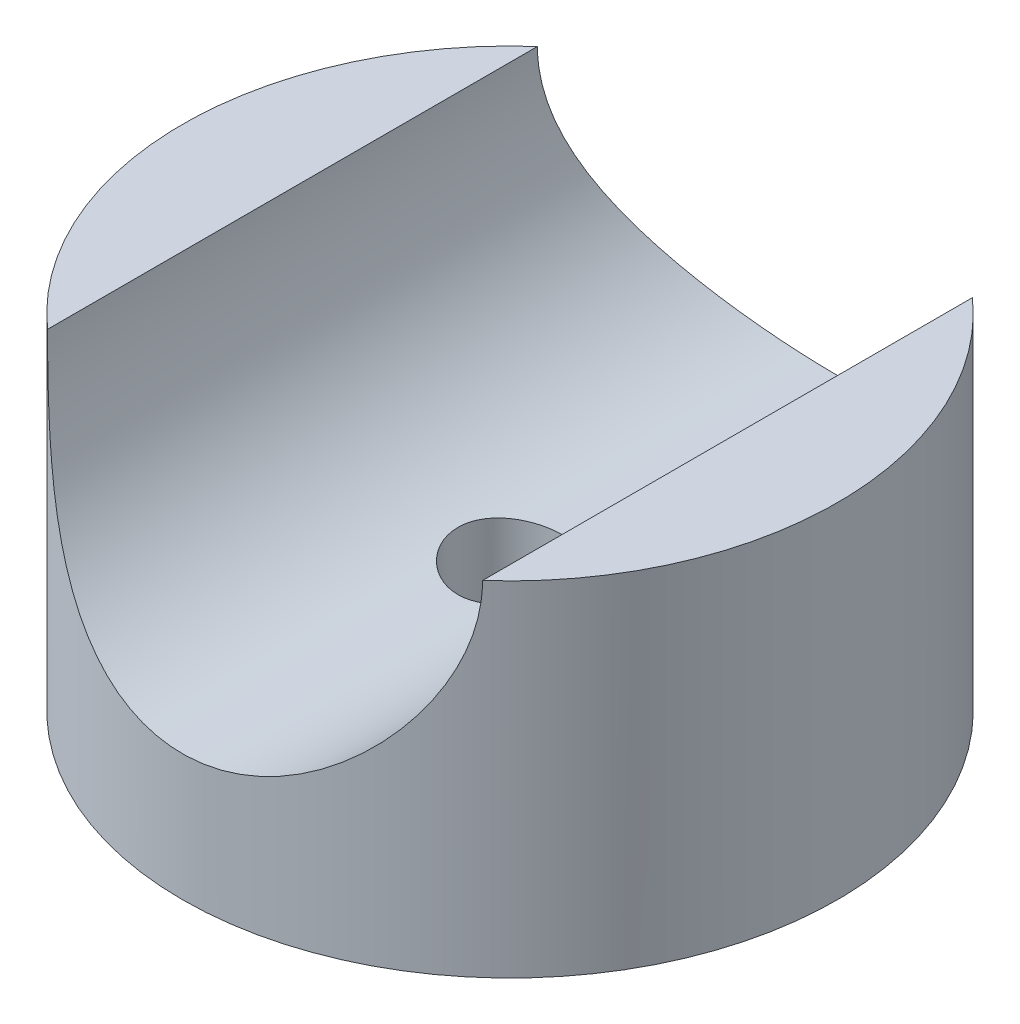
ISO-10303-21;
HEADER;
FILE_DESCRIPTION(('STEP AP214'),'2;1');
FILE_NAME('part.step','',(''),(''),'','','');
FILE_SCHEMA(('AUTOMOTIVE_DESIGN { 1 0 10303 214 1 1 1 1 }'));
ENDSEC;
DATA;
#1=APPLICATION_CONTEXT('core data for automotive mechanical design processes');
#2=APPLICATION_PROTOCOL_DEFINITION('international standard','automotive_design',2000,#1);
#3=PRODUCT_CONTEXT('',#1,'mechanical');
#4=PRODUCT('Part','Part','',(#3));
#5=PRODUCT_RELATED_PRODUCT_CATEGORY('part','',(#4));
#6=PRODUCT_DEFINITION_FORMATION('','',#4);
#7=PRODUCT_DEFINITION_CONTEXT('part definition',#1,'design');
#8=PRODUCT_DEFINITION('design','',#6,#7);
#9=PRODUCT_DEFINITION_SHAPE('','',#8);
#10=(LENGTH_UNIT() NAMED_UNIT(*) SI_UNIT(.MILLI.,.METRE.));
#11=(NAMED_UNIT(*) PLANE_ANGLE_UNIT() SI_UNIT($,.RADIAN.));
#12=(NAMED_UNIT(*) SI_UNIT($,.STERADIAN.) SOLID_ANGLE_UNIT());
#13=UNCERTAINTY_MEASURE_WITH_UNIT(LENGTH_MEASURE(1.E-05),#10,'distance_accuracy_value','');
#14=(GEOMETRIC_REPRESENTATION_CONTEXT(3) GLOBAL_UNCERTAINTY_ASSIGNED_CONTEXT((#13)) GLOBAL_UNIT_ASSIGNED_CONTEXT((#10,
#11,#12)) REPRESENTATION_CONTEXT('',''));
#15=CARTESIAN_POINT('',(0.,0.,0.));
#16=DIRECTION('',(0.,0.,1.));
#17=DIRECTION('',(1.,0.,0.));
#18=AXIS2_PLACEMENT_3D('',#15,#16,#17);
#19=CARTESIAN_POINT('',(0.,33.3375,0.));
#20=DIRECTION('',(0.,-1.,0.));
#21=DIRECTION('',(0.,0.,-1.));
#22=AXIS2_PLACEMENT_3D('',#19,#20,#21);
#23=CYLINDRICAL_SURFACE('',#22,31.75);
#24=CARTESIAN_POINT('',(0.,0.,0.));
#25=DIRECTION('',(0.,1.,0.));
#26=DIRECTION('',(0.,0.,1.));
#27=AXIS2_PLACEMENT_3D('',#24,#25,#26);
#28=CIRCLE('',#27,31.75);
#29=CARTESIAN_POINT('',(0.,0.,31.75));
#30=VERTEX_POINT('',#29);
#31=EDGE_CURVE('E154',#30,#30,#28,.T.);
#32=ORIENTED_EDGE('',*,*,#31,.T.);
#33=EDGE_LOOP('',(#32));
#34=FACE_BOUND('',#33,.T.);
#35=CARTESIAN_POINT('',(-21.082,33.3375,23.7405091773534));
#36=CARTESIAN_POINT('',(-21.0820090227909,33.0780918503218,23.740490377066));
#37=CARTESIAN_POINT('',(-21.0772123046933,32.8186913512447,23.7447604710367));
#38=CARTESIAN_POINT('',(-21.0580756657229,32.3005439909637,23.7617391651915));
#39=CARTESIAN_POINT('',(-21.0437366847969,32.0417970679,23.7744469342345));
#40=CARTESIAN_POINT('',(-21.0056085016833,31.5258784470475,23.808139896179));
#41=CARTESIAN_POINT('',(-20.9818315731884,31.26870514216,23.8291143383363));
#42=CARTESIAN_POINT('',(-20.9249629270465,30.7561904809237,23.8790670850276));
#43=CARTESIAN_POINT('',(-20.8918710546845,30.5008491550752,23.9080455225025));
#44=CARTESIAN_POINT('',(-20.7795966037933,29.7433749630778,24.0058495110462));
#45=CARTESIAN_POINT('',(-20.6870236176231,29.2445763238106,24.0858970060874));
#46=CARTESIAN_POINT('',(-20.4675719968932,28.2597009156855,24.2726519768399));
#47=CARTESIAN_POINT('',(-20.3406835334379,27.7736278355959,24.3793670902234));
#48=CARTESIAN_POINT('',(-20.0551860927163,26.8192937073484,24.6147521332039));
#49=CARTESIAN_POINT('',(-19.8967444776864,26.3509535726325,24.743305721062));
#50=CARTESIAN_POINT('',(-19.549522109133,25.4312646737433,25.0185476651443));
#51=CARTESIAN_POINT('',(-19.3607428674325,24.9799150642593,25.1652351176146));
#52=CARTESIAN_POINT('',(-18.9538945964859,24.0941913861639,25.4730760345858));
#53=CARTESIAN_POINT('',(-18.7357492930521,23.659865459983,25.6342667951731));
#54=CARTESIAN_POINT('',(-18.2719011172895,22.8102661386419,25.9669329109378));
#55=CARTESIAN_POINT('',(-18.0261946244101,22.3949952567499,26.1384096159392));
#56=CARTESIAN_POINT('',(-17.4687307709766,21.5221800188763,26.5148195640387));
#57=CARTESIAN_POINT('',(-17.1526193259433,21.0678884795173,26.7208576529895));
#58=CARTESIAN_POINT('',(-16.4866674024411,20.1866220599799,27.1368102172478));
#59=CARTESIAN_POINT('',(-16.1368246959048,19.7596489873847,27.3467249478797));
#60=CARTESIAN_POINT('',(-15.404427421705,18.9340660016095,27.7658817303125));
#61=CARTESIAN_POINT('',(-15.0218614705024,18.5354660477504,27.9751235215356));
#62=CARTESIAN_POINT('',(-14.225160066434,17.7682543081384,28.388532598589));
#63=CARTESIAN_POINT('',(-13.8110224764394,17.3996445559623,28.5926995396528));
#64=CARTESIAN_POINT('',(-12.8906541227297,16.6436270982305,29.0204504214031));
#65=CARTESIAN_POINT('',(-12.3797325472633,16.261101108049,29.2426215254748));
#66=CARTESIAN_POINT('',(-11.319978852129,15.5408924890259,29.6689535645463));
#67=CARTESIAN_POINT('',(-10.7711422019048,15.2032152333974,29.8731123405529));
#68=CARTESIAN_POINT('',(-9.63873569530124,14.5768016300742,30.257469600976));
#69=CARTESIAN_POINT('',(-9.05519189398004,14.2880291802348,30.4376857387814));
#70=CARTESIAN_POINT('',(-7.85685191226056,13.7633294792586,30.768790833652));
#71=CARTESIAN_POINT('',(-7.24206239511081,13.5273910186412,30.9196860106749));
#72=CARTESIAN_POINT('',(-6.05636061106152,13.1356075296996,31.1722380927949));
#73=CARTESIAN_POINT('',(-5.48819774471957,12.973765772761,31.277508847243));
#74=CARTESIAN_POINT('',(-4.33571488794643,12.6976534494025,31.4579734622825));
#75=CARTESIAN_POINT('',(-3.75139598456257,12.5833796906703,31.5331693412006));
#76=CARTESIAN_POINT('',(-2.57257500031857,12.4045685144908,31.6511435168479));
#77=CARTESIAN_POINT('',(-1.9780841881199,12.3399792944497,31.6939555771413));
#78=CARTESIAN_POINT('',(-0.784327112476878,12.2616089132215,31.7459300143005));
#79=CARTESIAN_POINT('',(-0.185061525793987,12.2478206756706,31.7550970777726));
#80=CARTESIAN_POINT('',(0.921465757098503,12.2695143025169,31.7406964630611));
#81=CARTESIAN_POINT('',(1.4289486061586,12.2978669267167,31.7218652640349));
#82=CARTESIAN_POINT('',(2.43904647821122,12.3909268854618,31.6602190662402));
#83=CARTESIAN_POINT('',(2.94166211574552,12.4556295678692,31.6174071365656));
#84=CARTESIAN_POINT('',(3.93850832964898,12.6204984441264,31.5087621967979));
#85=CARTESIAN_POINT('',(4.4327385470839,12.720666152048,31.4429282038491));
#86=CARTESIAN_POINT('',(5.40959899669538,12.9551718116787,31.2896661285821));
#87=CARTESIAN_POINT('',(5.89222872724975,13.0895112381246,31.2022371143001));
#88=CARTESIAN_POINT('',(6.84135365573494,13.3902305997755,31.0079379577901));
#89=CARTESIAN_POINT('',(7.30790083008422,13.5564930646908,30.9011391698445));
#90=CARTESIAN_POINT('',(8.22437204517871,13.9196371132374,30.6699457591024));
#91=CARTESIAN_POINT('',(8.67429637318827,14.1165181674333,30.5455514405589));
#92=CARTESIAN_POINT('',(9.55568305625259,14.5391348358899,30.2813985902901));
#93=CARTESIAN_POINT('',(9.9871448659889,14.7648713016549,30.1416396051806));
#94=CARTESIAN_POINT('',(10.8301608538517,15.2434861116723,29.8491078695759));
#95=CARTESIAN_POINT('',(11.2417126947778,15.4963676312792,29.6963335970201));
#96=CARTESIAN_POINT('',(12.0962774333143,16.0624668141657,29.3594992728853));
#97=CARTESIAN_POINT('',(12.5363493045039,16.379248829271,29.1739625187886));
#98=CARTESIAN_POINT('',(13.388213786791,17.043383968745,28.7929852060464));
#99=CARTESIAN_POINT('',(13.8000042832326,17.3907393747274,28.5975439087129));
#100=CARTESIAN_POINT('',(14.5948008820338,18.1147573215485,28.2002116804099));
#101=CARTESIAN_POINT('',(14.9777658331089,18.4914602551169,27.998312093945));
#102=CARTESIAN_POINT('',(15.7133168749952,19.2722904082029,27.5922216524479));
#103=CARTESIAN_POINT('',(16.0659015094297,19.6764189407951,27.388030688101));
#104=CARTESIAN_POINT('',(16.7914992711841,20.5750894349319,26.9502140910112));
#105=CARTESIAN_POINT('',(17.1593253411772,21.0739818686823,26.7168871716133));
#106=CARTESIAN_POINT('',(17.8514579065122,22.1053174095701,26.2594760149134));
#107=CARTESIAN_POINT('',(18.1757543142695,22.6377682516823,26.0353939283179));
#108=CARTESIAN_POINT('',(18.7780807962199,23.7341047226495,25.604358886339));
#109=CARTESIAN_POINT('',(19.0561582069833,24.2979573900388,25.3973885160685));
#110=CARTESIAN_POINT('',(19.5633369760471,25.4555329793231,25.0088074497082));
#111=CARTESIAN_POINT('',(19.7924629675903,26.049240690913,24.8271840146132));
#112=CARTESIAN_POINT('',(20.1416304325732,27.094209365323,24.5440977121144));
#113=CARTESIAN_POINT('',(20.2742771841316,27.5390596677897,24.4344009091089));
#114=CARTESIAN_POINT('',(20.5108009968017,28.4410680200279,24.2362000505806));
#115=CARTESIAN_POINT('',(20.6146778934379,28.8982261401461,24.1476961162167));
#116=CARTESIAN_POINT('',(20.7919601250261,29.8210698895039,23.9952195403173));
#117=CARTESIAN_POINT('',(20.8654517849675,30.286727381002,23.9311774423084));
#118=CARTESIAN_POINT('',(20.9811673796726,31.2246149234572,23.8297947487042));
#119=CARTESIAN_POINT('',(21.0234110207118,31.6968406404358,23.7924373251757));
#120=CARTESIAN_POINT('',(21.0604436352067,32.3646971110342,23.7596371548319));
#121=CARTESIAN_POINT('',(21.0685258482691,32.5591367900185,23.7524688704416));
#122=CARTESIAN_POINT('',(21.0793030406792,32.9482091654661,23.7429047985081));
#123=CARTESIAN_POINT('',(21.0820000478028,33.1428417616566,23.7405072145794));
#124=CARTESIAN_POINT('',(21.082,33.3375,23.7405091773534));
#125=B_SPLINE_CURVE_WITH_KNOTS('',3,(#35,#36,#37,#38,#39,#40,#41,#42,#43,#44,#45,#46,#47,#48,
#49,#50,#51,#52,#53,#54,#55,#56,#57,#58,#59,#60,#61,#62,#63,#64,#65,#66,#67,#68,#69,#70,#71,#72,
#73,#74,#75,#76,#77,#78,#79,#80,#81,#82,#83,#84,#85,#86,#87,#88,#89,#90,#91,#92,#93,#94,#95,#96,
#97,#98,#99,#100,#101,#102,#103,#104,#105,#106,#107,#108,#109,#110,#111,#112,#113,#114,#115,
#116,#117,#118,#119,#120,#121,#122,#123,#124),.UNSPECIFIED.,.F.,.F.,(4,2,2,2,2,2,2,2,2,2,2,2,2,
2,2,2,2,2,2,2,2,2,2,2,2,2,2,2,2,2,2,2,2,2,2,2,2,2,2,2,2,2,2,2,4),(0.,0.778131872105693,
1.5561871068051,2.33323380790057,3.11029341598251,4.64874928259056,6.18764627279088,
7.71858830269956,9.24945406440585,10.7843756437644,12.3194990933463,14.0894888650037,
15.8595956308583,17.6303206934076,19.4011657254476,21.4258972250682,23.4508710842315,
25.4743435037056,27.4973862071826,29.2948922705328,31.0922776828933,32.8877865375651,
34.6830452759207,36.2070670893669,37.7308939005136,39.2547857746734,40.7787434260512,
42.2971971283681,43.8156245775495,45.3340968448728,46.8527469329181,48.5703358810481,
50.2880531172799,52.0081777982636,53.7283848930412,55.7129402212083,57.6979546600837,
59.680923389499,61.6628918903462,63.0925372935345,64.5221908697572,65.9477543929,
67.3724181292655,67.9565285811316,68.5404190472373),.UNSPECIFIED.);
#126=CARTESIAN_POINT('',(-21.082,33.3375,23.7405091773534));
#127=VERTEX_POINT('',#126);
#128=CARTESIAN_POINT('',(21.082,33.3375,23.7405091773534));
#129=VERTEX_POINT('',#128);
#130=EDGE_CURVE('E60',#127,#129,#125,.T.);
#131=ORIENTED_EDGE('',*,*,#130,.F.);
#132=CARTESIAN_POINT('',(0.,33.3375,0.));
#133=DIRECTION('',(0.,1.,0.));
#134=DIRECTION('',(0.,0.,1.));
#135=AXIS2_PLACEMENT_3D('',#132,#133,#134);
#136=CIRCLE('',#135,31.75);
#137=CARTESIAN_POINT('',(-21.082,33.3375,-23.7405091773534));
#138=VERTEX_POINT('',#137);
#139=EDGE_CURVE('E47',#138,#127,#136,.T.);
#140=ORIENTED_EDGE('',*,*,#139,.F.);
#141=CARTESIAN_POINT('',(21.082,33.3375,-23.7405091773534));
#142=CARTESIAN_POINT('',(21.0820090227909,33.0780918503218,-23.740490377066));
#143=CARTESIAN_POINT('',(21.0772123046933,32.8186913512447,-23.7447604710367));
#144=CARTESIAN_POINT('',(21.0580756657229,32.3005439909637,-23.7617391651915));
#145=CARTESIAN_POINT('',(21.0437366847969,32.0417970679,-23.7744469342345));
#146=CARTESIAN_POINT('',(21.0056085016833,31.5258784470475,-23.808139896179));
#147=CARTESIAN_POINT('',(20.9818315731884,31.26870514216,-23.8291143383363));
#148=CARTESIAN_POINT('',(20.9249629270465,30.7561904809237,-23.8790670850276));
#149=CARTESIAN_POINT('',(20.8918710546845,30.5008491550752,-23.9080455225025));
#150=CARTESIAN_POINT('',(20.7795966037933,29.7433749630778,-24.0058495110462));
#151=CARTESIAN_POINT('',(20.6870236176231,29.2445763238106,-24.0858970060874));
#152=CARTESIAN_POINT('',(20.4675719968932,28.2597009156855,-24.2726519768399));
#153=CARTESIAN_POINT('',(20.3406835334379,27.7736278355959,-24.3793670902234));
#154=CARTESIAN_POINT('',(20.0551860927163,26.8192937073484,-24.6147521332039));
#155=CARTESIAN_POINT('',(19.8967444776864,26.3509535726325,-24.743305721062));
#156=CARTESIAN_POINT('',(19.549522109133,25.4312646737433,-25.0185476651443));
#157=CARTESIAN_POINT('',(19.3607428674325,24.9799150642593,-25.1652351176146));
#158=CARTESIAN_POINT('',(18.9538945964859,24.0941913861639,-25.4730760345858));
#159=CARTESIAN_POINT('',(18.7357492930521,23.659865459983,-25.6342667951731));
#160=CARTESIAN_POINT('',(18.2719011172895,22.8102661386419,-25.9669329109378));
#161=CARTESIAN_POINT('',(18.0261946244101,22.3949952567499,-26.1384096159392));
#162=CARTESIAN_POINT('',(17.4687307709766,21.5221800188763,-26.5148195640387));
#163=CARTESIAN_POINT('',(17.1526193259433,21.0678884795173,-26.7208576529895));
#164=CARTESIAN_POINT('',(16.4866674024411,20.1866220599799,-27.1368102172478));
#165=CARTESIAN_POINT('',(16.1368246959048,19.7596489873847,-27.3467249478797));
#166=CARTESIAN_POINT('',(15.404427421705,18.9340660016095,-27.7658817303125));
#167=CARTESIAN_POINT('',(15.0218614705024,18.5354660477504,-27.9751235215356));
#168=CARTESIAN_POINT('',(14.225160066434,17.7682543081384,-28.388532598589));
#169=CARTESIAN_POINT('',(13.8110224764394,17.3996445559623,-28.5926995396528));
#170=CARTESIAN_POINT('',(12.8906541227297,16.6436270982305,-29.0204504214031));
#171=CARTESIAN_POINT('',(12.3797325472633,16.261101108049,-29.2426215254748));
#172=CARTESIAN_POINT('',(11.319978852129,15.5408924890259,-29.6689535645463));
#173=CARTESIAN_POINT('',(10.7711422019048,15.2032152333974,-29.8731123405529));
#174=CARTESIAN_POINT('',(9.63873569530124,14.5768016300742,-30.257469600976));
#175=CARTESIAN_POINT('',(9.05519189398004,14.2880291802348,-30.4376857387814));
#176=CARTESIAN_POINT('',(7.85685191226056,13.7633294792586,-30.768790833652));
#177=CARTESIAN_POINT('',(7.24206239511081,13.5273910186412,-30.9196860106749));
#178=CARTESIAN_POINT('',(6.05636061106152,13.1356075296996,-31.1722380927949));
#179=CARTESIAN_POINT('',(5.48819774471957,12.973765772761,-31.277508847243));
#180=CARTESIAN_POINT('',(4.33571488794643,12.6976534494025,-31.4579734622825));
#181=CARTESIAN_POINT('',(3.75139598456257,12.5833796906703,-31.5331693412006));
#182=CARTESIAN_POINT('',(2.57257500031857,12.4045685144908,-31.6511435168479));
#183=CARTESIAN_POINT('',(1.9780841881199,12.3399792944497,-31.6939555771413));
#184=CARTESIAN_POINT('',(0.784327112476878,12.2616089132215,-31.7459300143005));
#185=CARTESIAN_POINT('',(0.185061525793987,12.2478206756706,-31.7550970777726));
#186=CARTESIAN_POINT('',(-0.921465757098503,12.2695143025169,-31.7406964630611));
#187=CARTESIAN_POINT('',(-1.4289486061586,12.2978669267167,-31.7218652640349));
#188=CARTESIAN_POINT('',(-2.43904647821122,12.3909268854618,-31.6602190662402));
#189=CARTESIAN_POINT('',(-2.94166211574552,12.4556295678692,-31.6174071365656));
#190=CARTESIAN_POINT('',(-3.93850832964898,12.6204984441264,-31.5087621967979));
#191=CARTESIAN_POINT('',(-4.4327385470839,12.720666152048,-31.4429282038491));
#192=CARTESIAN_POINT('',(-5.40959899669538,12.9551718116787,-31.2896661285821));
#193=CARTESIAN_POINT('',(-5.89222872724975,13.0895112381246,-31.2022371143001));
#194=CARTESIAN_POINT('',(-6.84135365573494,13.3902305997755,-31.0079379577901));
#195=CARTESIAN_POINT('',(-7.30790083008422,13.5564930646908,-30.9011391698445));
#196=CARTESIAN_POINT('',(-8.22437204517871,13.9196371132374,-30.6699457591024));
#197=CARTESIAN_POINT('',(-8.67429637318827,14.1165181674333,-30.5455514405589));
#198=CARTESIAN_POINT('',(-9.55568305625259,14.5391348358899,-30.2813985902901));
#199=CARTESIAN_POINT('',(-9.9871448659889,14.7648713016549,-30.1416396051806));
#200=CARTESIAN_POINT('',(-10.8301608538517,15.2434861116723,-29.8491078695759));
#201=CARTESIAN_POINT('',(-11.2417126947778,15.4963676312792,-29.6963335970201));
#202=CARTESIAN_POINT('',(-12.0962774333143,16.0624668141657,-29.3594992728853));
#203=CARTESIAN_POINT('',(-12.5363493045039,16.379248829271,-29.1739625187886));
#204=CARTESIAN_POINT('',(-13.388213786791,17.043383968745,-28.7929852060464));
#205=CARTESIAN_POINT('',(-13.8000042832326,17.3907393747274,-28.5975439087129));
#206=CARTESIAN_POINT('',(-14.5948008820338,18.1147573215485,-28.2002116804099));
#207=CARTESIAN_POINT('',(-14.9777658331089,18.4914602551169,-27.998312093945));
#208=CARTESIAN_POINT('',(-15.7133168749952,19.2722904082029,-27.5922216524479));
#209=CARTESIAN_POINT('',(-16.0659015094297,19.6764189407951,-27.388030688101));
#210=CARTESIAN_POINT('',(-16.7914992711841,20.5750894349319,-26.9502140910112));
#211=CARTESIAN_POINT('',(-17.1593253411772,21.0739818686823,-26.7168871716133));
#212=CARTESIAN_POINT('',(-17.8514579065122,22.1053174095701,-26.2594760149134));
#213=CARTESIAN_POINT('',(-18.1757543142695,22.6377682516823,-26.0353939283179));
#214=CARTESIAN_POINT('',(-18.7780807962199,23.7341047226495,-25.604358886339));
#215=CARTESIAN_POINT('',(-19.0561582069833,24.2979573900388,-25.3973885160685));
#216=CARTESIAN_POINT('',(-19.5633369760471,25.4555329793231,-25.0088074497082));
#217=CARTESIAN_POINT('',(-19.7924629675903,26.049240690913,-24.8271840146132));
#218=CARTESIAN_POINT('',(-20.1416304325732,27.094209365323,-24.5440977121144));
#219=CARTESIAN_POINT('',(-20.2742771841316,27.5390596677897,-24.4344009091089));
#220=CARTESIAN_POINT('',(-20.5108009968017,28.4410680200279,-24.2362000505806));
#221=CARTESIAN_POINT('',(-20.6146778934379,28.8982261401461,-24.1476961162167));
#222=CARTESIAN_POINT('',(-20.7919601250261,29.8210698895039,-23.9952195403173));
#223=CARTESIAN_POINT('',(-20.8654517849675,30.286727381002,-23.9311774423084));
#224=CARTESIAN_POINT('',(-20.9811673796726,31.2246149234572,-23.8297947487042));
#225=CARTESIAN_POINT('',(-21.0234110207118,31.6968406404358,-23.7924373251757));
#226=CARTESIAN_POINT('',(-21.0604436352067,32.3646971110342,-23.7596371548319));
#227=CARTESIAN_POINT('',(-21.0685258482691,32.5591367900185,-23.7524688704416));
#228=CARTESIAN_POINT('',(-21.0793030406792,32.9482091654661,-23.7429047985081));
#229=CARTESIAN_POINT('',(-21.0820000478028,33.1428417616566,-23.7405072145794));
#230=CARTESIAN_POINT('',(-21.082,33.3375,-23.7405091773534));
#231=B_SPLINE_CURVE_WITH_KNOTS('',3,(#141,#142,#143,#144,#145,#146,#147,#148,#149,#150,#151,
#152,#153,#154,#155,#156,#157,#158,#159,#160,#161,#162,#163,#164,#165,#166,#167,#168,#169,#170,
#171,#172,#173,#174,#175,#176,#177,#178,#179,#180,#181,#182,#183,#184,#185,#186,#187,#188,#189,
#190,#191,#192,#193,#194,#195,#196,#197,#198,#199,#200,#201,#202,#203,#204,#205,#206,#207,#208,
#209,#210,#211,#212,#213,#214,#215,#216,#217,#218,#219,#220,#221,#222,#223,#224,#225,#226,#227,
#228,#229,#230),.UNSPECIFIED.,.F.,.F.,(4,2,2,2,2,2,2,2,2,2,2,2,2,2,2,2,2,2,2,2,2,2,2,2,2,2,2,2,
2,2,2,2,2,2,2,2,2,2,2,2,2,2,2,2,4),(0.,0.778131872105693,1.5561871068051,2.33323380790057,
3.11029341598251,4.64874928259056,6.18764627279088,7.71858830269956,9.24945406440585,
10.7843756437644,12.3194990933463,14.0894888650037,15.8595956308583,17.6303206934076,
19.4011657254476,21.4258972250682,23.4508710842315,25.4743435037056,27.4973862071826,
29.2948922705328,31.0922776828933,32.8877865375651,34.6830452759207,36.2070670893669,
37.7308939005136,39.2547857746734,40.7787434260512,42.2971971283681,43.8156245775495,
45.3340968448728,46.8527469329181,48.5703358810481,50.2880531172799,52.0081777982636,
53.7283848930412,55.7129402212083,57.6979546600837,59.680923389499,61.6628918903462,
63.0925372935345,64.5221908697572,65.9477543929,67.3724181292655,67.9565285811316,
68.5404190472373),.UNSPECIFIED.);
#232=CARTESIAN_POINT('',(21.082,33.3375,-23.7405091773534));
#233=VERTEX_POINT('',#232);
#234=EDGE_CURVE('E55',#233,#138,#231,.T.);
#235=ORIENTED_EDGE('',*,*,#234,.F.);
#236=EDGE_CURVE('E11',#129,#233,#136,.T.);
#237=ORIENTED_EDGE('',*,*,#236,.F.);
#238=EDGE_LOOP('',(#131,#140,#235,#237));
#239=FACE_BOUND('',#238,.T.);
#240=ADVANCED_FACE('F33',(#34,#239),#23,.T.);
#241=CARTESIAN_POINT('',(0.,33.3375,0.));
#242=DIRECTION('',(0.,1.,0.));
#243=DIRECTION('',(0.,0.,1.));
#244=AXIS2_PLACEMENT_3D('',#241,#242,#243);
#245=PLANE('',#244);
#246=ORIENTED_EDGE('',*,*,#236,.T.);
#247=DIRECTION('',(0.,0.,-1.));
#248=VECTOR('',#247,1.);
#249=CARTESIAN_POINT('',(21.082,33.3375,50.8));
#250=LINE('',#249,#248);
#251=EDGE_CURVE('E158',#233,#129,#250,.F.);
#252=ORIENTED_EDGE('',*,*,#251,.T.);
#253=EDGE_LOOP('',(#246,#252));
#254=FACE_BOUND('',#253,.T.);
#255=ADVANCED_FACE('F138',(#254),#245,.T.);
#256=ORIENTED_EDGE('',*,*,#139,.T.);
#257=DIRECTION('',(0.,0.,-1.));
#258=VECTOR('',#257,1.);
#259=CARTESIAN_POINT('',(-21.082,33.3375,50.8));
#260=LINE('',#259,#258);
#261=EDGE_CURVE('E111',#127,#138,#260,.T.);
#262=ORIENTED_EDGE('',*,*,#261,.T.);
#263=EDGE_LOOP('',(#256,#262));
#264=FACE_BOUND('',#263,.T.);
#265=ADVANCED_FACE('F136',(#264),#245,.T.);
#266=CARTESIAN_POINT('',(0.,33.3375,0.));
#267=DIRECTION('',(0.,1.,0.));
#268=DIRECTION('',(0.,0.,1.));
#269=AXIS2_PLACEMENT_3D('',#266,#267,#268);
#270=CYLINDRICAL_SURFACE('',#269,5.04189999999999);
#271=CARTESIAN_POINT('',(0.,0.,0.));
#272=DIRECTION('',(0.,1.,0.));
#273=DIRECTION('',(0.,0.,1.));
#274=AXIS2_PLACEMENT_3D('',#271,#272,#273);
#275=CIRCLE('',#274,5.04189999999999);
#276=CARTESIAN_POINT('',(0.,0.,5.04189999999999));
#277=VERTEX_POINT('',#276);
#278=EDGE_CURVE('E160',#277,#277,#275,.T.);
#279=ORIENTED_EDGE('',*,*,#278,.F.);
#280=EDGE_LOOP('',(#279));
#281=FACE_BOUND('',#280,.T.);
#282=CARTESIAN_POINT('',(0.,12.2555,5.04189999999999));
#283=CARTESIAN_POINT('',(-0.278953916575847,12.255504936432,5.04189150687474));
#284=CARTESIAN_POINT('',(-0.558005350337544,12.261092180915,5.01867141362874));
#285=CARTESIAN_POINT('',(-1.10813619730728,12.2828400835393,4.92652817640919));
#286=CARTESIAN_POINT('',(-1.37921055913808,12.2990072969003,4.85757669746904));
#287=CARTESIAN_POINT('',(-1.90536123974115,12.3401213061316,4.67628981348121));
#288=CARTESIAN_POINT('',(-2.16045549128083,12.3650580451588,4.56400408959599));
#289=CARTESIAN_POINT('',(-2.64818300532051,12.4210425683145,4.29940486237115));
#290=CARTESIAN_POINT('',(-2.880815983156,12.4520904298775,4.14709085182127));
#291=CARTESIAN_POINT('',(-3.32143254274263,12.5175738737706,3.80370519186331));
#292=CARTESIAN_POINT('',(-3.5289292998062,12.5520581141909,3.61201811007658));
#293=CARTESIAN_POINT('',(-3.90915567926218,12.62019754418,3.19664653774288));
#294=CARTESIAN_POINT('',(-4.08188169082183,12.6538526473275,2.97295872814272));
#295=CARTESIAN_POINT('',(-4.38990172501699,12.7170096851099,2.49622055600774));
#296=CARTESIAN_POINT('',(-4.52466068088797,12.7464496280638,2.24281553314257));
#297=CARTESIAN_POINT('',(-4.74948358679368,12.7971372645965,1.71613262907912));
#298=CARTESIAN_POINT('',(-4.83955402100646,12.8183861465753,1.44285763755834));
#299=CARTESIAN_POINT('',(-4.97080096471882,12.8497872150567,0.889520026450774));
#300=CARTESIAN_POINT('',(-5.0128480888304,12.8601367172816,0.609675359306981));
#301=CARTESIAN_POINT('',(-5.04956503288161,12.8691585243488,0.0467274248664374));
#302=CARTESIAN_POINT('',(-5.0442418699771,12.8678325587266,-0.23637535358785));
#303=CARTESIAN_POINT('',(-4.98706612169787,12.8538310854113,-0.791204293162731));
#304=CARTESIAN_POINT('',(-4.93624138664453,12.8414063062204,-1.06304368021434));
#305=CARTESIAN_POINT('',(-4.79114081149666,12.8070055865774,-1.59422145772989));
#306=CARTESIAN_POINT('',(-4.69686211128897,12.7850290174377,-1.85355902409041));
#307=CARTESIAN_POINT('',(-4.46662970429315,12.7337647242569,-2.35517558075076));
#308=CARTESIAN_POINT('',(-4.33029501702006,12.7044106380177,-2.59727264222204));
#309=CARTESIAN_POINT('',(-4.02008760604436,12.6417373811318,-3.05552600063933));
#310=CARTESIAN_POINT('',(-3.84620883124537,12.6084175717062,-3.27167810720899));
#311=CARTESIAN_POINT('',(-3.46048262860073,12.5405041553565,-3.6778062855282));
#312=CARTESIAN_POINT('',(-3.24776534491913,12.5058999572676,-3.86695538613523));
#313=CARTESIAN_POINT('',(-2.79322224072446,12.4401009533453,-4.20704556940933));
#314=CARTESIAN_POINT('',(-2.55139567345613,12.4089062350163,-4.35798567157318));
#315=CARTESIAN_POINT('',(-2.04438043179126,12.3533064793004,-4.61764049109225));
#316=CARTESIAN_POINT('',(-1.77912543193607,12.3289215877687,-4.72623028941964));
#317=CARTESIAN_POINT('',(-1.23341574470723,12.2898364057441,-4.89705491422918));
#318=CARTESIAN_POINT('',(-0.952963720641873,12.275134424205,-4.95929783508762));
#319=CARTESIAN_POINT('',(-0.391899650734714,12.2573183943493,-5.03442069025686));
#320=CARTESIAN_POINT('',(-0.111446739949608,12.2539397448676,-5.04842800234422));
#321=CARTESIAN_POINT('',(0.447793853117461,12.2584018163911,-5.02976097492126));
#322=CARTESIAN_POINT('',(0.726581669925253,12.2662416183807,-4.99709045925865));
#323=CARTESIAN_POINT('',(1.27072644619207,12.2920910399364,-4.88692674842005));
#324=CARTESIAN_POINT('',(1.53621332025335,12.3099629757894,-4.81004004541631));
#325=CARTESIAN_POINT('',(2.05051332687072,12.3538684141532,-4.6143121552773));
#326=CARTESIAN_POINT('',(2.29932485994295,12.3799026982333,-4.49546695035314));
#327=CARTESIAN_POINT('',(2.77776085644742,12.4378862827092,-4.2169519912989));
#328=CARTESIAN_POINT('',(3.00699998506757,12.4699262791808,-4.05663962898871));
#329=CARTESIAN_POINT('',(3.43572484622501,12.5362101319347,-3.70057115811423));
#330=CARTESIAN_POINT('',(3.63520589475751,12.5704543339534,-3.50480948044216));
#331=CARTESIAN_POINT('',(4.00333103378485,12.638225959623,-3.07818481876512));
#332=CARTESIAN_POINT('',(4.17118764422654,12.6717203350237,-2.84663601723641));
#333=CARTESIAN_POINT('',(4.46565000304855,12.7333398600812,-2.3579828829261));
#334=CARTESIAN_POINT('',(4.59225759834247,12.7614652501095,-2.10087969500821));
#335=CARTESIAN_POINT('',(4.79970722000074,12.808864792089,-1.56981811439516));
#336=CARTESIAN_POINT('',(4.88081893707329,12.8281909726029,-1.2959699532573));
#337=CARTESIAN_POINT('',(4.99571881952962,12.855872249661,-0.737997695426071));
#338=CARTESIAN_POINT('',(5.02951630108256,12.8642295059653,-0.453875632968274));
#339=CARTESIAN_POINT('',(5.04837325388242,12.8688721607175,0.108593844938421));
#340=CARTESIAN_POINT('',(5.03468743163841,12.8654683455037,0.3868973349372));
#341=CARTESIAN_POINT('',(4.96181382988484,12.8476852785176,0.937106051912657));
#342=CARTESIAN_POINT('',(4.90262681932349,12.8333062122217,1.20901138693505));
#343=CARTESIAN_POINT('',(4.74108870486291,12.7953584122208,1.73747381155724));
#344=CARTESIAN_POINT('',(4.63895397858086,12.7718357895491,1.99410057835592));
#345=CARTESIAN_POINT('',(4.3945945081473,12.7182410249231,2.48675025425217));
#346=CARTESIAN_POINT('',(4.25236468324472,12.6881680530348,2.72277054718123));
#347=CARTESIAN_POINT('',(3.92783692724986,12.6239595932151,3.17361540455151));
#348=CARTESIAN_POINT('',(3.74465971531561,12.5897439607597,3.38779574383278));
#349=CARTESIAN_POINT('',(3.34517557694735,12.5216044733378,3.78278707585073));
#350=CARTESIAN_POINT('',(3.12886088704011,12.4876806887176,3.96359022700998));
#351=CARTESIAN_POINT('',(2.66501744753443,12.4232931416938,4.28953142445704));
#352=CARTESIAN_POINT('',(2.4170401599368,12.3928942667913,4.43404486374597));
#353=CARTESIAN_POINT('',(1.89961741429839,12.3396527316422,4.67910442660694));
#354=CARTESIAN_POINT('',(1.63018848929621,12.316804320793,4.77968403005003));
#355=CARTESIAN_POINT('',(1.13412598920801,12.2848718136159,4.91799489280645));
#356=CARTESIAN_POINT('',(0.909980182110706,12.2739302952218,4.96436326801669));
#357=CARTESIAN_POINT('',(0.457244570269583,12.2592425911098,5.02631833622839));
#358=CARTESIAN_POINT('',(0.228655045430645,12.2554959536682,5.04190696170881));
#359=CARTESIAN_POINT('',(0.,12.2555,5.04189999999999));
#360=B_SPLINE_CURVE_WITH_KNOTS('',3,(#282,#283,#284,#285,#286,#287,#288,#289,#290,#291,#292,
#293,#294,#295,#296,#297,#298,#299,#300,#301,#302,#303,#304,#305,#306,#307,#308,#309,#310,#311,
#312,#313,#314,#315,#316,#317,#318,#319,#320,#321,#322,#323,#324,#325,#326,#327,#328,#329,#330,
#331,#332,#333,#334,#335,#336,#337,#338,#339,#340,#341,#342,#343,#344,#345,#346,#347,#348,#349,
#350,#351,#352,#353,#354,#355,#356,#357,#358,#359),.UNSPECIFIED.,.T.,.F.,(4,2,2,2,2,2,2,2,2,2,2,
2,2,2,2,2,2,2,2,2,2,2,2,2,2,2,2,2,2,2,2,2,2,2,2,2,2,2,4),(0.,0.836024171112594,1.67256682366142,
2.50815324545369,3.34375025571918,4.19356663197541,5.04347121352018,5.90481428168224,
6.76603233482611,7.61137637529573,8.45659519355315,9.28318979802046,10.1098388162058,
10.9442079157118,11.7787115935731,12.6349185094542,13.4911473947298,14.3498831009697,
15.2084687957808,16.0468459010157,16.885154330335,17.7122293909484,18.5393836706594,
19.3802164547322,20.221181448899,21.0809129981605,21.9406060478801,22.7951476391422,
23.6495209475569,24.4814920192447,25.3134490313303,26.1412637993437,26.9691835131724,
27.816962607669,28.6649406251044,29.5266432714721,30.3876881050366,31.0730097172572,
31.7582883008074),.UNSPECIFIED.);
#361=CARTESIAN_POINT('',(0.,12.2555,5.04189999999999));
#362=VERTEX_POINT('',#361);
#363=EDGE_CURVE('E37',#362,#362,#360,.T.);
#364=ORIENTED_EDGE('',*,*,#363,.F.);
#365=EDGE_LOOP('',(#364));
#366=FACE_BOUND('',#365,.T.);
#367=ADVANCED_FACE('F130',(#281,#366),#270,.F.);
#368=CARTESIAN_POINT('',(0.,0.,0.));
#369=DIRECTION('',(0.,1.,0.));
#370=DIRECTION('',(0.,0.,1.));
#371=AXIS2_PLACEMENT_3D('',#368,#369,#370);
#372=PLANE('',#371);
#373=CARTESIAN_POINT('',(-25.4,0.,9.525));
#374=DIRECTION('',(0.,-1.,0.));
#375=DIRECTION('',(0.,0.,-1.));
#376=AXIS2_PLACEMENT_3D('',#373,#374,#375);
#377=CIRCLE('',#376,1.89864999999999);
#378=CARTESIAN_POINT('',(-25.4,0.,7.62635000000001));
#379=VERTEX_POINT('',#378);
#380=EDGE_CURVE('E89',#379,#379,#377,.T.);
#381=ORIENTED_EDGE('',*,*,#380,.F.);
#382=EDGE_LOOP('',(#381));
#383=FACE_BOUND('',#382,.T.);
#384=CARTESIAN_POINT('',(-25.4,0.,-9.525));
#385=DIRECTION('',(0.,-1.,0.));
#386=DIRECTION('',(0.,0.,-1.));
#387=AXIS2_PLACEMENT_3D('',#384,#385,#386);
#388=CIRCLE('',#387,1.89864999999999);
#389=CARTESIAN_POINT('',(-25.4,0.,-11.42365));
#390=VERTEX_POINT('',#389);
#391=EDGE_CURVE('E88',#390,#390,#388,.T.);
#392=ORIENTED_EDGE('',*,*,#391,.F.);
#393=EDGE_LOOP('',(#392));
#394=FACE_BOUND('',#393,.T.);
#395=CARTESIAN_POINT('',(25.4,0.,-9.52499999999999));
#396=DIRECTION('',(0.,-1.,0.));
#397=DIRECTION('',(0.,0.,-1.));
#398=AXIS2_PLACEMENT_3D('',#395,#396,#397);
#399=CIRCLE('',#398,1.89864999999999);
#400=CARTESIAN_POINT('',(25.4,0.,-11.42365));
#401=VERTEX_POINT('',#400);
#402=EDGE_CURVE('E99',#401,#401,#399,.T.);
#403=ORIENTED_EDGE('',*,*,#402,.F.);
#404=EDGE_LOOP('',(#403));
#405=FACE_BOUND('',#404,.T.);
#406=CARTESIAN_POINT('',(25.4,0.,9.52500000000001));
#407=DIRECTION('',(0.,-1.,0.));
#408=DIRECTION('',(0.,0.,-1.));
#409=AXIS2_PLACEMENT_3D('',#406,#407,#408);
#410=CIRCLE('',#409,1.89864999999999);
#411=CARTESIAN_POINT('',(25.4,0.,7.62635000000002));
#412=VERTEX_POINT('',#411);
#413=EDGE_CURVE('E105',#412,#412,#410,.T.);
#414=ORIENTED_EDGE('',*,*,#413,.F.);
#415=EDGE_LOOP('',(#414));
#416=FACE_BOUND('',#415,.T.);
#417=ORIENTED_EDGE('',*,*,#278,.T.);
#418=EDGE_LOOP('',(#417));
#419=FACE_BOUND('',#418,.T.);
#420=ORIENTED_EDGE('',*,*,#31,.F.);
#421=EDGE_LOOP('',(#420));
#422=FACE_BOUND('',#421,.T.);
#423=ADVANCED_FACE('F128',(#383,#394,#405,#416,#419,#422),#372,.F.);
#424=CARTESIAN_POINT('',(0.,33.3375,50.8));
#425=DIRECTION('',(0.,0.,-1.));
#426=DIRECTION('',(-1.,0.,0.));
#427=AXIS2_PLACEMENT_3D('',#424,#425,#426);
#428=CYLINDRICAL_SURFACE('',#427,21.082);
#429=ORIENTED_EDGE('',*,*,#234,.T.);
#430=ORIENTED_EDGE('',*,*,#261,.F.);
#431=ORIENTED_EDGE('',*,*,#130,.T.);
#432=ORIENTED_EDGE('',*,*,#251,.F.);
#433=EDGE_LOOP('',(#429,#430,#431,#432));
#434=FACE_BOUND('',#433,.T.);
#435=ORIENTED_EDGE('',*,*,#363,.T.);
#436=EDGE_LOOP('',(#435));
#437=FACE_BOUND('',#436,.T.);
#438=ADVANCED_FACE('F123',(#434,#437),#428,.F.);
#439=CARTESIAN_POINT('',(25.4,19.05,9.52500000000001));
#440=DIRECTION('',(0.,-1.,0.));
#441=DIRECTION('',(0.,0.,-1.));
#442=AXIS2_PLACEMENT_3D('',#439,#440,#441);
#443=CONICAL_SURFACE('',#442,1.89864999999999,1.02974425867665);
#444=CARTESIAN_POINT('',(25.4,20.1908240143167,9.52500000000001));
#445=VERTEX_POINT('',#444);
#446=VERTEX_LOOP('',#445);
#447=FACE_BOUND('',#446,.T.);
#448=CARTESIAN_POINT('',(25.4,19.05,9.52500000000001));
#449=DIRECTION('',(0.,-1.,0.));
#450=DIRECTION('',(0.,0.,-1.));
#451=AXIS2_PLACEMENT_3D('',#448,#449,#450);
#452=CIRCLE('',#451,1.89864999999999);
#453=CARTESIAN_POINT('',(25.4,19.05,7.62635000000001));
#454=VERTEX_POINT('',#453);
#455=EDGE_CURVE('E108',#454,#454,#452,.T.);
#456=ORIENTED_EDGE('',*,*,#455,.T.);
#457=EDGE_LOOP('',(#456));
#458=FACE_BOUND('',#457,.T.);
#459=ADVANCED_FACE('F127',(#447,#458),#443,.F.);
#460=CARTESIAN_POINT('',(25.4,0.,9.52500000000001));
#461=DIRECTION('',(0.,-1.,0.));
#462=DIRECTION('',(0.,0.,-1.));
#463=AXIS2_PLACEMENT_3D('',#460,#461,#462);
#464=CYLINDRICAL_SURFACE('',#463,1.89864999999999);
#465=ORIENTED_EDGE('',*,*,#455,.F.);
#466=EDGE_LOOP('',(#465));
#467=FACE_BOUND('',#466,.T.);
#468=ORIENTED_EDGE('',*,*,#413,.T.);
#469=EDGE_LOOP('',(#468));
#470=FACE_BOUND('',#469,.T.);
#471=ADVANCED_FACE('F199',(#467,#470),#464,.F.);
#472=CARTESIAN_POINT('',(25.4,19.05,-9.52499999999999));
#473=DIRECTION('',(0.,-1.,0.));
#474=DIRECTION('',(0.,0.,-1.));
#475=AXIS2_PLACEMENT_3D('',#472,#473,#474);
#476=CONICAL_SURFACE('',#475,1.89864999999999,1.02974425867665);
#477=CARTESIAN_POINT('',(25.4,20.1908240143167,-9.52499999999999));
#478=VERTEX_POINT('',#477);
#479=VERTEX_LOOP('',#478);
#480=FACE_BOUND('',#479,.T.);
#481=CARTESIAN_POINT('',(25.4,19.05,-9.52499999999999));
#482=DIRECTION('',(0.,-1.,0.));
#483=DIRECTION('',(0.,0.,-1.));
#484=AXIS2_PLACEMENT_3D('',#481,#482,#483);
#485=CIRCLE('',#484,1.89864999999999);
#486=CARTESIAN_POINT('',(25.4,19.05,-11.42365));
#487=VERTEX_POINT('',#486);
#488=EDGE_CURVE('E102',#487,#487,#485,.T.);
#489=ORIENTED_EDGE('',*,*,#488,.T.);
#490=EDGE_LOOP('',(#489));
#491=FACE_BOUND('',#490,.T.);
#492=ADVANCED_FACE('F208',(#480,#491),#476,.F.);
#493=CARTESIAN_POINT('',(25.4,0.,-9.52499999999999));
#494=DIRECTION('',(0.,-1.,0.));
#495=DIRECTION('',(0.,0.,-1.));
#496=AXIS2_PLACEMENT_3D('',#493,#494,#495);
#497=CYLINDRICAL_SURFACE('',#496,1.89864999999999);
#498=ORIENTED_EDGE('',*,*,#488,.F.);
#499=EDGE_LOOP('',(#498));
#500=FACE_BOUND('',#499,.T.);
#501=ORIENTED_EDGE('',*,*,#402,.T.);
#502=EDGE_LOOP('',(#501));
#503=FACE_BOUND('',#502,.T.);
#504=ADVANCED_FACE('F217',(#500,#503),#497,.F.);
#505=CARTESIAN_POINT('',(-25.4,19.05,-9.525));
#506=DIRECTION('',(0.,-1.,0.));
#507=DIRECTION('',(0.,0.,-1.));
#508=AXIS2_PLACEMENT_3D('',#505,#506,#507);
#509=CONICAL_SURFACE('',#508,1.89864999999999,1.02974425867665);
#510=CARTESIAN_POINT('',(-25.4,20.1908240143167,-9.525));
#511=VERTEX_POINT('',#510);
#512=VERTEX_LOOP('',#511);
#513=FACE_BOUND('',#512,.T.);
#514=CARTESIAN_POINT('',(-25.4,19.05,-9.525));
#515=DIRECTION('',(0.,-1.,0.));
#516=DIRECTION('',(0.,0.,-1.));
#517=AXIS2_PLACEMENT_3D('',#514,#515,#516);
#518=CIRCLE('',#517,1.89864999999999);
#519=CARTESIAN_POINT('',(-25.4,19.05,-11.42365));
#520=VERTEX_POINT('',#519);
#521=EDGE_CURVE('E92',#520,#520,#518,.T.);
#522=ORIENTED_EDGE('',*,*,#521,.T.);
#523=EDGE_LOOP('',(#522));
#524=FACE_BOUND('',#523,.T.);
#525=ADVANCED_FACE('F227',(#513,#524),#509,.F.);
#526=CARTESIAN_POINT('',(-25.4,0.,-9.525));
#527=DIRECTION('',(0.,-1.,0.));
#528=DIRECTION('',(0.,0.,-1.));
#529=AXIS2_PLACEMENT_3D('',#526,#527,#528);
#530=CYLINDRICAL_SURFACE('',#529,1.89864999999999);
#531=ORIENTED_EDGE('',*,*,#521,.F.);
#532=EDGE_LOOP('',(#531));
#533=FACE_BOUND('',#532,.T.);
#534=ORIENTED_EDGE('',*,*,#391,.T.);
#535=EDGE_LOOP('',(#534));
#536=FACE_BOUND('',#535,.T.);
#537=ADVANCED_FACE('F82',(#533,#536),#530,.F.);
#538=CARTESIAN_POINT('',(-25.4,19.05,9.525));
#539=DIRECTION('',(0.,-1.,0.));
#540=DIRECTION('',(0.,0.,-1.));
#541=AXIS2_PLACEMENT_3D('',#538,#539,#540);
#542=CONICAL_SURFACE('',#541,1.89864999999999,1.02974425867665);
#543=CARTESIAN_POINT('',(-25.4,20.1908240143167,9.525));
#544=VERTEX_POINT('',#543);
#545=VERTEX_LOOP('',#544);
#546=FACE_BOUND('',#545,.T.);
#547=CARTESIAN_POINT('',(-25.4,19.05,9.525));
#548=DIRECTION('',(0.,-1.,0.));
#549=DIRECTION('',(0.,0.,-1.));
#550=AXIS2_PLACEMENT_3D('',#547,#548,#549);
#551=CIRCLE('',#550,1.89864999999999);
#552=CARTESIAN_POINT('',(-25.4,19.05,7.62635));
#553=VERTEX_POINT('',#552);
#554=EDGE_CURVE('E86',#553,#553,#551,.T.);
#555=ORIENTED_EDGE('',*,*,#554,.T.);
#556=EDGE_LOOP('',(#555));
#557=FACE_BOUND('',#556,.T.);
#558=ADVANCED_FACE('F78',(#546,#557),#542,.F.);
#559=CARTESIAN_POINT('',(-25.4,0.,9.525));
#560=DIRECTION('',(0.,-1.,0.));
#561=DIRECTION('',(0.,0.,-1.));
#562=AXIS2_PLACEMENT_3D('',#559,#560,#561);
#563=CYLINDRICAL_SURFACE('',#562,1.89864999999999);
#564=ORIENTED_EDGE('',*,*,#554,.F.);
#565=EDGE_LOOP('',(#564));
#566=FACE_BOUND('',#565,.T.);
#567=ORIENTED_EDGE('',*,*,#380,.T.);
#568=EDGE_LOOP('',(#567));
#569=FACE_BOUND('',#568,.T.);
#570=ADVANCED_FACE('F81',(#566,#569),#563,.F.);
#571=CLOSED_SHELL('',(#240,#255,#265,#367,#423,#438,#459,#471,#492,#504,#525,#537,#558,#570));
#572=MANIFOLD_SOLID_BREP('B2',#571);
#573=ADVANCED_BREP_SHAPE_REPRESENTATION('',(#18,#572),#14);
#574=SHAPE_DEFINITION_REPRESENTATION(#9,#573);
ENDSEC;
END-ISO-10303-21;
